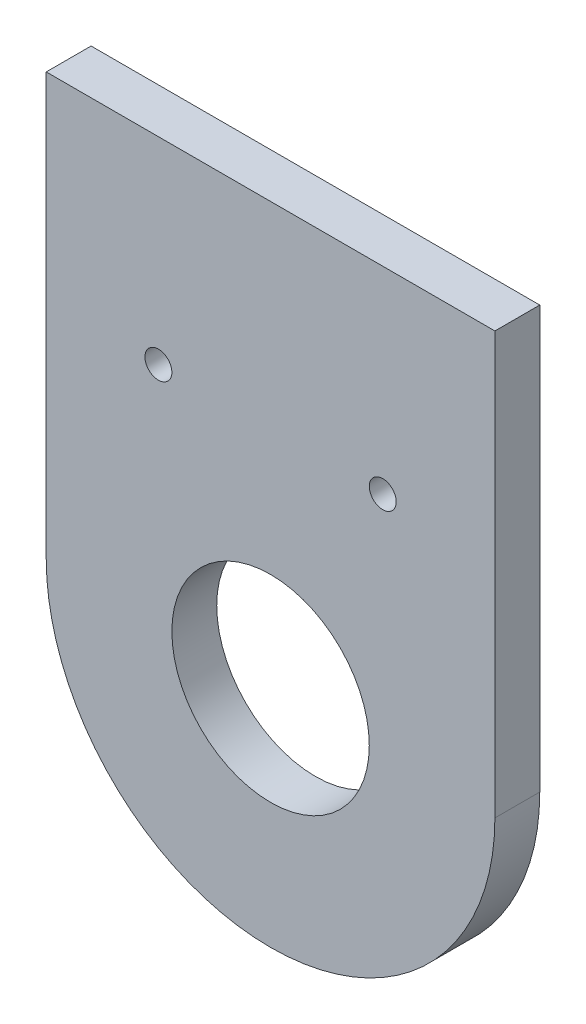
ISO-10303-21;
HEADER;
FILE_DESCRIPTION(('STEP AP214'),'2;1');
FILE_NAME('part.step','',(''),(''),'','','');
FILE_SCHEMA(('AUTOMOTIVE_DESIGN { 1 0 10303 214 1 1 1 1 }'));
ENDSEC;
DATA;
#1=APPLICATION_CONTEXT('core data for automotive mechanical design processes');
#2=APPLICATION_PROTOCOL_DEFINITION('international standard','automotive_design',2000,#1);
#3=PRODUCT_CONTEXT('',#1,'mechanical');
#4=PRODUCT('Part','Part','',(#3));
#5=PRODUCT_RELATED_PRODUCT_CATEGORY('part','',(#4));
#6=PRODUCT_DEFINITION_FORMATION('','',#4);
#7=PRODUCT_DEFINITION_CONTEXT('part definition',#1,'design');
#8=PRODUCT_DEFINITION('design','',#6,#7);
#9=PRODUCT_DEFINITION_SHAPE('','',#8);
#10=(LENGTH_UNIT() NAMED_UNIT(*) SI_UNIT(.MILLI.,.METRE.));
#11=(NAMED_UNIT(*) PLANE_ANGLE_UNIT() SI_UNIT($,.RADIAN.));
#12=(NAMED_UNIT(*) SI_UNIT($,.STERADIAN.) SOLID_ANGLE_UNIT());
#13=UNCERTAINTY_MEASURE_WITH_UNIT(LENGTH_MEASURE(1.E-05),#10,'distance_accuracy_value','');
#14=(GEOMETRIC_REPRESENTATION_CONTEXT(3) GLOBAL_UNCERTAINTY_ASSIGNED_CONTEXT((#13)) GLOBAL_UNIT_ASSIGNED_CONTEXT((#10,
#11,#12)) REPRESENTATION_CONTEXT('',''));
#15=CARTESIAN_POINT('',(0.,0.,0.));
#16=DIRECTION('',(0.,0.,1.));
#17=DIRECTION('',(1.,0.,0.));
#18=AXIS2_PLACEMENT_3D('',#15,#16,#17);
#19=CARTESIAN_POINT('',(0.,47.,5.));
#20=DIRECTION('',(0.,1.,0.));
#21=DIRECTION('',(0.,0.,1.));
#22=AXIS2_PLACEMENT_3D('',#19,#20,#21);
#23=PLANE('',#22);
#24=DIRECTION('',(1.,0.,0.));
#25=VECTOR('',#24,1.);
#26=CARTESIAN_POINT('',(0.,47.,5.));
#27=LINE('',#26,#25);
#28=CARTESIAN_POINT('',(-25.,47.,5.));
#29=VERTEX_POINT('',#28);
#30=CARTESIAN_POINT('',(25.,47.,5.));
#31=VERTEX_POINT('',#30);
#32=EDGE_CURVE('E12',#29,#31,#27,.T.);
#33=ORIENTED_EDGE('',*,*,#32,.T.);
#34=DIRECTION('',(0.,0.,1.));
#35=VECTOR('',#34,1.);
#36=CARTESIAN_POINT('',(25.,47.,0.));
#37=LINE('',#36,#35);
#38=CARTESIAN_POINT('',(25.,47.,0.));
#39=VERTEX_POINT('',#38);
#40=EDGE_CURVE('E168',#39,#31,#37,.T.);
#41=ORIENTED_EDGE('',*,*,#40,.F.);
#42=DIRECTION('',(1.,0.,0.));
#43=VECTOR('',#42,1.);
#44=CARTESIAN_POINT('',(0.,47.,0.));
#45=LINE('',#44,#43);
#46=CARTESIAN_POINT('',(-25.,47.,0.));
#47=VERTEX_POINT('',#46);
#48=EDGE_CURVE('E97',#47,#39,#45,.T.);
#49=ORIENTED_EDGE('',*,*,#48,.F.);
#50=DIRECTION('',(0.,0.,1.));
#51=VECTOR('',#50,1.);
#52=CARTESIAN_POINT('',(-25.,47.,0.));
#53=LINE('',#52,#51);
#54=EDGE_CURVE('E110',#47,#29,#53,.T.);
#55=ORIENTED_EDGE('',*,*,#54,.T.);
#56=EDGE_LOOP('',(#33,#41,#49,#55));
#57=FACE_BOUND('',#56,.T.);
#58=ADVANCED_FACE('F93',(#57),#23,.T.);
#59=CARTESIAN_POINT('',(0.,0.,5.));
#60=DIRECTION('',(0.,0.,1.));
#61=DIRECTION('',(1.,0.,0.));
#62=AXIS2_PLACEMENT_3D('',#59,#60,#61);
#63=PLANE('',#62);
#64=CARTESIAN_POINT('',(12.5,25.,5.));
#65=DIRECTION('',(0.,0.,1.));
#66=DIRECTION('',(1.,0.,0.));
#67=AXIS2_PLACEMENT_3D('',#64,#65,#66);
#68=CIRCLE('',#67,1.5);
#69=CARTESIAN_POINT('',(14.,25.,5.));
#70=VERTEX_POINT('',#69);
#71=EDGE_CURVE('E215',#70,#70,#68,.T.);
#72=ORIENTED_EDGE('',*,*,#71,.F.);
#73=EDGE_LOOP('',(#72));
#74=FACE_BOUND('',#73,.T.);
#75=CARTESIAN_POINT('',(-12.5,25.,5.));
#76=DIRECTION('',(0.,0.,1.));
#77=DIRECTION('',(1.,0.,0.));
#78=AXIS2_PLACEMENT_3D('',#75,#76,#77);
#79=CIRCLE('',#78,1.5);
#80=CARTESIAN_POINT('',(-11.,25.,5.));
#81=VERTEX_POINT('',#80);
#82=EDGE_CURVE('E163',#81,#81,#79,.T.);
#83=ORIENTED_EDGE('',*,*,#82,.F.);
#84=EDGE_LOOP('',(#83));
#85=FACE_BOUND('',#84,.T.);
#86=CARTESIAN_POINT('',(0.,0.,5.));
#87=DIRECTION('',(0.,0.,1.));
#88=DIRECTION('',(1.,0.,0.));
#89=AXIS2_PLACEMENT_3D('',#86,#87,#88);
#90=CIRCLE('',#89,11.);
#91=CARTESIAN_POINT('',(11.,0.,5.));
#92=VERTEX_POINT('',#91);
#93=EDGE_CURVE('E102',#92,#92,#90,.T.);
#94=ORIENTED_EDGE('',*,*,#93,.F.);
#95=EDGE_LOOP('',(#94));
#96=FACE_BOUND('',#95,.T.);
#97=CARTESIAN_POINT('',(0.,0.,5.));
#98=DIRECTION('',(0.,0.,1.));
#99=DIRECTION('',(1.,0.,0.));
#100=AXIS2_PLACEMENT_3D('',#97,#98,#99);
#101=CIRCLE('',#100,25.);
#102=CARTESIAN_POINT('',(-25.,0.,5.));
#103=VERTEX_POINT('',#102);
#104=CARTESIAN_POINT('',(25.,0.,5.));
#105=VERTEX_POINT('',#104);
#106=EDGE_CURVE('E142',#103,#105,#101,.T.);
#107=ORIENTED_EDGE('',*,*,#106,.T.);
#108=DIRECTION('',(0.,1.,0.));
#109=VECTOR('',#108,1.);
#110=CARTESIAN_POINT('',(25.,0.,5.));
#111=LINE('',#110,#109);
#112=EDGE_CURVE('E137',#105,#31,#111,.T.);
#113=ORIENTED_EDGE('',*,*,#112,.T.);
#114=ORIENTED_EDGE('',*,*,#32,.F.);
#115=DIRECTION('',(0.,1.,0.));
#116=VECTOR('',#115,1.);
#117=CARTESIAN_POINT('',(-25.,0.,5.));
#118=LINE('',#117,#116);
#119=EDGE_CURVE('E155',#103,#29,#118,.T.);
#120=ORIENTED_EDGE('',*,*,#119,.F.);
#121=EDGE_LOOP('',(#107,#113,#114,#120));
#122=FACE_BOUND('',#121,.T.);
#123=ADVANCED_FACE('F180',(#74,#85,#96,#122),#63,.T.);
#124=CARTESIAN_POINT('',(0.,0.,0.));
#125=DIRECTION('',(0.,0.,1.));
#126=DIRECTION('',(1.,0.,0.));
#127=AXIS2_PLACEMENT_3D('',#124,#125,#126);
#128=PLANE('',#127);
#129=CARTESIAN_POINT('',(12.5,25.,0.));
#130=DIRECTION('',(0.,0.,1.));
#131=DIRECTION('',(1.,0.,0.));
#132=AXIS2_PLACEMENT_3D('',#129,#130,#131);
#133=CIRCLE('',#132,1.5);
#134=CARTESIAN_POINT('',(14.,25.,0.));
#135=VERTEX_POINT('',#134);
#136=EDGE_CURVE('E158',#135,#135,#133,.T.);
#137=ORIENTED_EDGE('',*,*,#136,.T.);
#138=EDGE_LOOP('',(#137));
#139=FACE_BOUND('',#138,.T.);
#140=CARTESIAN_POINT('',(-12.5,25.,0.));
#141=DIRECTION('',(0.,0.,1.));
#142=DIRECTION('',(1.,0.,0.));
#143=AXIS2_PLACEMENT_3D('',#140,#141,#142);
#144=CIRCLE('',#143,1.5);
#145=CARTESIAN_POINT('',(-11.,25.,0.));
#146=VERTEX_POINT('',#145);
#147=EDGE_CURVE('E211',#146,#146,#144,.T.);
#148=ORIENTED_EDGE('',*,*,#147,.T.);
#149=EDGE_LOOP('',(#148));
#150=FACE_BOUND('',#149,.T.);
#151=CARTESIAN_POINT('',(0.,0.,0.));
#152=DIRECTION('',(0.,0.,1.));
#153=DIRECTION('',(1.,0.,0.));
#154=AXIS2_PLACEMENT_3D('',#151,#152,#153);
#155=CIRCLE('',#154,11.);
#156=CARTESIAN_POINT('',(11.,0.,0.));
#157=VERTEX_POINT('',#156);
#158=EDGE_CURVE('E167',#157,#157,#155,.T.);
#159=ORIENTED_EDGE('',*,*,#158,.T.);
#160=EDGE_LOOP('',(#159));
#161=FACE_BOUND('',#160,.T.);
#162=DIRECTION('',(0.,1.,0.));
#163=VECTOR('',#162,1.);
#164=CARTESIAN_POINT('',(25.,0.,0.));
#165=LINE('',#164,#163);
#166=CARTESIAN_POINT('',(25.,0.,0.));
#167=VERTEX_POINT('',#166);
#168=EDGE_CURVE('E144',#167,#39,#165,.T.);
#169=ORIENTED_EDGE('',*,*,#168,.F.);
#170=CARTESIAN_POINT('',(0.,0.,0.));
#171=DIRECTION('',(0.,0.,1.));
#172=DIRECTION('',(1.,0.,0.));
#173=AXIS2_PLACEMENT_3D('',#170,#171,#172);
#174=CIRCLE('',#173,25.);
#175=CARTESIAN_POINT('',(-25.,0.,0.));
#176=VERTEX_POINT('',#175);
#177=EDGE_CURVE('E119',#176,#167,#174,.T.);
#178=ORIENTED_EDGE('',*,*,#177,.F.);
#179=DIRECTION('',(0.,1.,0.));
#180=VECTOR('',#179,1.);
#181=CARTESIAN_POINT('',(-25.,0.,0.));
#182=LINE('',#181,#180);
#183=EDGE_CURVE('E146',#176,#47,#182,.T.);
#184=ORIENTED_EDGE('',*,*,#183,.T.);
#185=ORIENTED_EDGE('',*,*,#48,.T.);
#186=EDGE_LOOP('',(#169,#178,#184,#185));
#187=FACE_BOUND('',#186,.T.);
#188=ADVANCED_FACE('F153',(#139,#150,#161,#187),#128,.F.);
#189=CARTESIAN_POINT('',(0.,0.,5.));
#190=DIRECTION('',(0.,0.,-1.));
#191=DIRECTION('',(-1.,0.,0.));
#192=AXIS2_PLACEMENT_3D('',#189,#190,#191);
#193=CYLINDRICAL_SURFACE('',#192,11.);
#194=ORIENTED_EDGE('',*,*,#93,.T.);
#195=EDGE_LOOP('',(#194));
#196=FACE_BOUND('',#195,.T.);
#197=ORIENTED_EDGE('',*,*,#158,.F.);
#198=EDGE_LOOP('',(#197));
#199=FACE_BOUND('',#198,.T.);
#200=ADVANCED_FACE('F95',(#196,#199),#193,.F.);
#201=CARTESIAN_POINT('',(0.,0.,0.));
#202=DIRECTION('',(0.,0.,1.));
#203=DIRECTION('',(1.,0.,0.));
#204=AXIS2_PLACEMENT_3D('',#201,#202,#203);
#205=CYLINDRICAL_SURFACE('',#204,25.);
#206=ORIENTED_EDGE('',*,*,#106,.F.);
#207=DIRECTION('',(0.,0.,1.));
#208=VECTOR('',#207,1.);
#209=CARTESIAN_POINT('',(-25.,0.,0.));
#210=LINE('',#209,#208);
#211=EDGE_CURVE('E139',#176,#103,#210,.T.);
#212=ORIENTED_EDGE('',*,*,#211,.F.);
#213=ORIENTED_EDGE('',*,*,#177,.T.);
#214=DIRECTION('',(0.,0.,1.));
#215=VECTOR('',#214,1.);
#216=CARTESIAN_POINT('',(25.,0.,0.));
#217=LINE('',#216,#215);
#218=EDGE_CURVE('E165',#167,#105,#217,.T.);
#219=ORIENTED_EDGE('',*,*,#218,.T.);
#220=EDGE_LOOP('',(#206,#212,#213,#219));
#221=FACE_BOUND('',#220,.T.);
#222=ADVANCED_FACE('F140',(#221),#205,.T.);
#223=CARTESIAN_POINT('',(25.,0.,0.));
#224=DIRECTION('',(1.,0.,0.));
#225=DIRECTION('',(0.,0.,-1.));
#226=AXIS2_PLACEMENT_3D('',#223,#224,#225);
#227=PLANE('',#226);
#228=ORIENTED_EDGE('',*,*,#112,.F.);
#229=ORIENTED_EDGE('',*,*,#218,.F.);
#230=ORIENTED_EDGE('',*,*,#168,.T.);
#231=ORIENTED_EDGE('',*,*,#40,.T.);
#232=EDGE_LOOP('',(#228,#229,#230,#231));
#233=FACE_BOUND('',#232,.T.);
#234=ADVANCED_FACE('F178',(#233),#227,.T.);
#235=CARTESIAN_POINT('',(-25.,0.,0.));
#236=DIRECTION('',(1.,0.,0.));
#237=DIRECTION('',(0.,1.,0.));
#238=AXIS2_PLACEMENT_3D('',#235,#236,#237);
#239=PLANE('',#238);
#240=ORIENTED_EDGE('',*,*,#119,.T.);
#241=ORIENTED_EDGE('',*,*,#54,.F.);
#242=ORIENTED_EDGE('',*,*,#183,.F.);
#243=ORIENTED_EDGE('',*,*,#211,.T.);
#244=EDGE_LOOP('',(#240,#241,#242,#243));
#245=FACE_BOUND('',#244,.T.);
#246=ADVANCED_FACE('F147',(#245),#239,.F.);
#247=CARTESIAN_POINT('',(-12.5,25.,0.));
#248=DIRECTION('',(0.,0.,1.));
#249=DIRECTION('',(1.,0.,0.));
#250=AXIS2_PLACEMENT_3D('',#247,#248,#249);
#251=CYLINDRICAL_SURFACE('',#250,1.5);
#252=ORIENTED_EDGE('',*,*,#147,.F.);
#253=EDGE_LOOP('',(#252));
#254=FACE_BOUND('',#253,.T.);
#255=ORIENTED_EDGE('',*,*,#82,.T.);
#256=EDGE_LOOP('',(#255));
#257=FACE_BOUND('',#256,.T.);
#258=ADVANCED_FACE('F197',(#254,#257),#251,.F.);
#259=CARTESIAN_POINT('',(12.5,25.,0.));
#260=DIRECTION('',(0.,0.,1.));
#261=DIRECTION('',(1.,0.,0.));
#262=AXIS2_PLACEMENT_3D('',#259,#260,#261);
#263=CYLINDRICAL_SURFACE('',#262,1.5);
#264=ORIENTED_EDGE('',*,*,#136,.F.);
#265=EDGE_LOOP('',(#264));
#266=FACE_BOUND('',#265,.T.);
#267=ORIENTED_EDGE('',*,*,#71,.T.);
#268=EDGE_LOOP('',(#267));
#269=FACE_BOUND('',#268,.T.);
#270=ADVANCED_FACE('F200',(#266,#269),#263,.F.);
#271=CLOSED_SHELL('',(#58,#123,#188,#200,#222,#234,#246,#258,#270));
#272=MANIFOLD_SOLID_BREP('B2',#271);
#273=ADVANCED_BREP_SHAPE_REPRESENTATION('',(#18,#272),#14);
#274=SHAPE_DEFINITION_REPRESENTATION(#9,#273);
ENDSEC;
END-ISO-10303-21;
